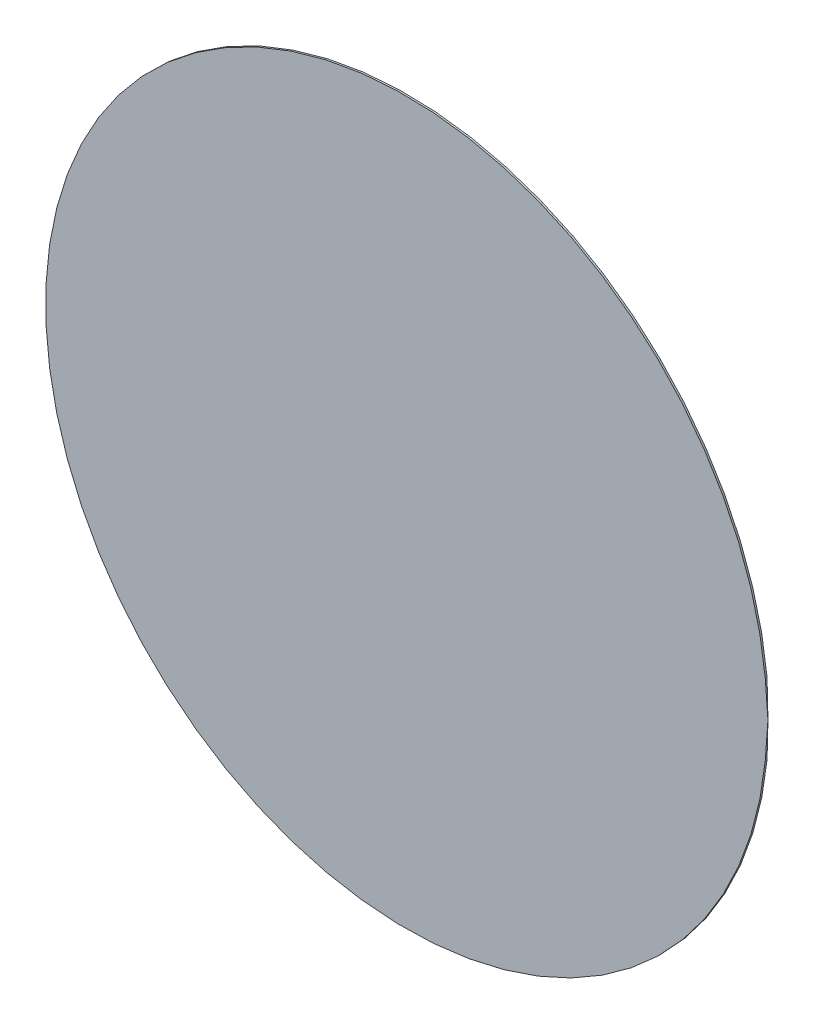
ISO-10303-21;
HEADER;
FILE_DESCRIPTION(('STEP AP214'),'2;1');
FILE_NAME('part.step','',(''),(''),'','','');
FILE_SCHEMA(('AUTOMOTIVE_DESIGN { 1 0 10303 214 1 1 1 1 }'));
ENDSEC;
DATA;
#1=APPLICATION_CONTEXT('core data for automotive mechanical design processes');
#2=APPLICATION_PROTOCOL_DEFINITION('international standard','automotive_design',2000,#1);
#3=PRODUCT_CONTEXT('',#1,'mechanical');
#4=PRODUCT('Part','Part','',(#3));
#5=PRODUCT_RELATED_PRODUCT_CATEGORY('part','',(#4));
#6=PRODUCT_DEFINITION_FORMATION('','',#4);
#7=PRODUCT_DEFINITION_CONTEXT('part definition',#1,'design');
#8=PRODUCT_DEFINITION('design','',#6,#7);
#9=PRODUCT_DEFINITION_SHAPE('','',#8);
#10=(LENGTH_UNIT() NAMED_UNIT(*) SI_UNIT(.MILLI.,.METRE.));
#11=(NAMED_UNIT(*) PLANE_ANGLE_UNIT() SI_UNIT($,.RADIAN.));
#12=(NAMED_UNIT(*) SI_UNIT($,.STERADIAN.) SOLID_ANGLE_UNIT());
#13=UNCERTAINTY_MEASURE_WITH_UNIT(LENGTH_MEASURE(1.E-05),#10,'distance_accuracy_value','');
#14=(GEOMETRIC_REPRESENTATION_CONTEXT(3) GLOBAL_UNCERTAINTY_ASSIGNED_CONTEXT((#13)) GLOBAL_UNIT_ASSIGNED_CONTEXT((#10,
#11,#12)) REPRESENTATION_CONTEXT('',''));
#15=CARTESIAN_POINT('',(0.,0.,0.));
#16=DIRECTION('',(0.,0.,1.));
#17=DIRECTION('',(1.,0.,0.));
#18=AXIS2_PLACEMENT_3D('',#15,#16,#17);
#19=CARTESIAN_POINT('',(0.,0.,0.001));
#20=DIRECTION('',(0.,0.,1.));
#21=DIRECTION('',(1.,0.,0.));
#22=AXIS2_PLACEMENT_3D('',#19,#20,#21);
#23=PLANE('',#22);
#24=CARTESIAN_POINT('',(0.,0.,0.001));
#25=DIRECTION('',(0.,0.,1.));
#26=DIRECTION('',(1.,0.,0.));
#27=AXIS2_PLACEMENT_3D('',#24,#25,#26);
#28=CIRCLE('',#27,0.2);
#29=CARTESIAN_POINT('',(0.2,0.,0.0005));
#30=VERTEX_POINT('',#29);
#31=EDGE_CURVE('E24',#30,#30,#28,.F.);
#32=ORIENTED_EDGE('',*,*,#31,.F.);
#33=EDGE_LOOP('',(#32));
#34=FACE_BOUND('',#33,.T.);
#35=ADVANCED_FACE('F17',(#34),#23,.T.);
#36=CARTESIAN_POINT('',(0.,0.,0.));
#37=DIRECTION('',(0.,0.,1.));
#38=DIRECTION('',(1.,0.,0.));
#39=AXIS2_PLACEMENT_3D('',#36,#37,#38);
#40=CYLINDRICAL_SURFACE('',#39,0.2);
#41=CARTESIAN_POINT('',(0.,0.,0.));
#42=DIRECTION('',(0.,0.,1.));
#43=DIRECTION('',(1.,0.,0.));
#44=AXIS2_PLACEMENT_3D('',#41,#42,#43);
#45=CIRCLE('',#44,0.2);
#46=EDGE_CURVE('E11',#30,#30,#45,.T.);
#47=ORIENTED_EDGE('',*,*,#46,.T.);
#48=ORIENTED_EDGE('',*,*,#31,.T.);
#49=EDGE_LOOP('',(#47,#48));
#50=FACE_BOUND('',#49,.T.);
#51=ADVANCED_FACE('F33',(#50),#40,.T.);
#52=CARTESIAN_POINT('',(0.,0.,0.));
#53=DIRECTION('',(0.,0.,1.));
#54=DIRECTION('',(1.,0.,0.));
#55=AXIS2_PLACEMENT_3D('',#52,#53,#54);
#56=PLANE('',#55);
#57=ORIENTED_EDGE('',*,*,#46,.F.);
#58=EDGE_LOOP('',(#57));
#59=FACE_BOUND('',#58,.T.);
#60=ADVANCED_FACE('F35',(#59),#56,.F.);
#61=CLOSED_SHELL('',(#35,#51,#60));
#62=MANIFOLD_SOLID_BREP('B1',#61);
#63=ADVANCED_BREP_SHAPE_REPRESENTATION('',(#18,#62),#14);
#64=SHAPE_DEFINITION_REPRESENTATION(#9,#63);
ENDSEC;
END-ISO-10303-21;
